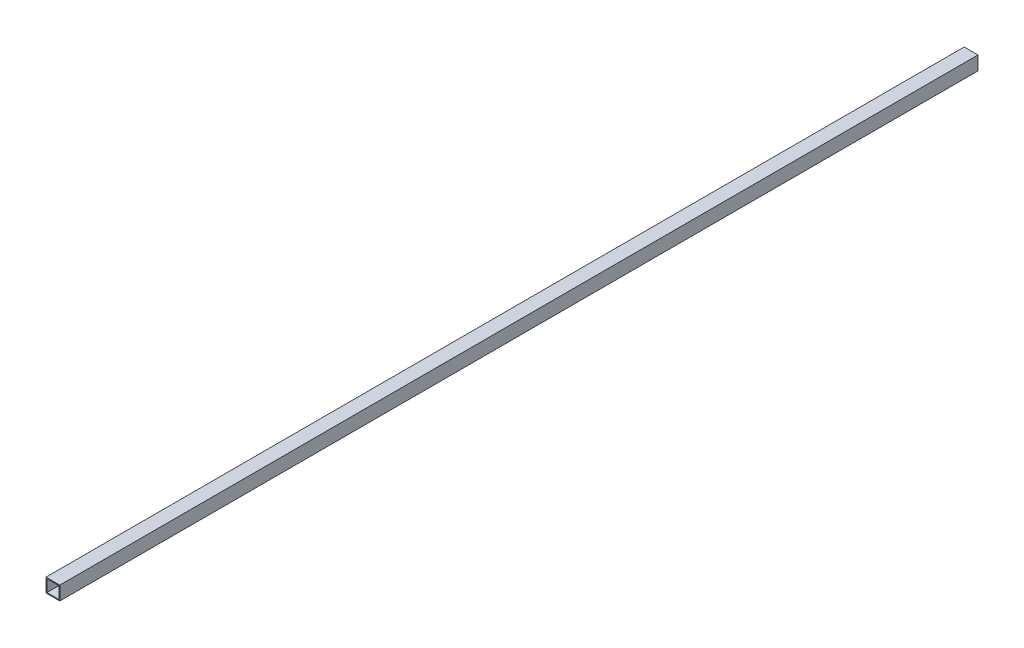
ISO-10303-21;
HEADER;
FILE_DESCRIPTION(('STEP AP214'),'2;1');
FILE_NAME('part.step','',(''),(''),'','','');
FILE_SCHEMA(('AUTOMOTIVE_DESIGN { 1 0 10303 214 1 1 1 1 }'));
ENDSEC;
DATA;
#1=APPLICATION_CONTEXT('core data for automotive mechanical design processes');
#2=APPLICATION_PROTOCOL_DEFINITION('international standard','automotive_design',2000,#1);
#3=PRODUCT_CONTEXT('',#1,'mechanical');
#4=PRODUCT('Part','Part','',(#3));
#5=PRODUCT_RELATED_PRODUCT_CATEGORY('part','',(#4));
#6=PRODUCT_DEFINITION_FORMATION('','',#4);
#7=PRODUCT_DEFINITION_CONTEXT('part definition',#1,'design');
#8=PRODUCT_DEFINITION('design','',#6,#7);
#9=PRODUCT_DEFINITION_SHAPE('','',#8);
#10=(LENGTH_UNIT() NAMED_UNIT(*) SI_UNIT(.MILLI.,.METRE.));
#11=(NAMED_UNIT(*) PLANE_ANGLE_UNIT() SI_UNIT($,.RADIAN.));
#12=(NAMED_UNIT(*) SI_UNIT($,.STERADIAN.) SOLID_ANGLE_UNIT());
#13=UNCERTAINTY_MEASURE_WITH_UNIT(LENGTH_MEASURE(1.E-05),#10,'distance_accuracy_value','');
#14=(GEOMETRIC_REPRESENTATION_CONTEXT(3) GLOBAL_UNCERTAINTY_ASSIGNED_CONTEXT((#13)) GLOBAL_UNIT_ASSIGNED_CONTEXT((#10,
#11,#12)) REPRESENTATION_CONTEXT('',''));
#15=CARTESIAN_POINT('',(0.,0.,0.));
#16=DIRECTION('',(0.,0.,1.));
#17=DIRECTION('',(1.,0.,0.));
#18=AXIS2_PLACEMENT_3D('',#15,#16,#17);
#19=CARTESIAN_POINT('',(0.,0.,1995.5));
#20=DIRECTION('',(0.,0.,-1.));
#21=DIRECTION('',(-1.,0.,0.));
#22=AXIS2_PLACEMENT_3D('',#19,#20,#21);
#23=PLANE('',#22);
#24=DIRECTION('',(0.,-1.,0.));
#25=VECTOR('',#24,1.);
#26=CARTESIAN_POINT('',(-15.,15.,1995.5));
#27=LINE('',#26,#25);
#28=CARTESIAN_POINT('',(-15.,15.,1995.5));
#29=VERTEX_POINT('',#28);
#30=CARTESIAN_POINT('',(-15.,-15.,1995.5));
#31=VERTEX_POINT('',#30);
#32=EDGE_CURVE('E135',#29,#31,#27,.T.);
#33=ORIENTED_EDGE('',*,*,#32,.T.);
#34=DIRECTION('',(1.,0.,0.));
#35=VECTOR('',#34,1.);
#36=CARTESIAN_POINT('',(15.,-15.,1995.5));
#37=LINE('',#36,#35);
#38=CARTESIAN_POINT('',(15.,-15.,1995.5));
#39=VERTEX_POINT('',#38);
#40=EDGE_CURVE('E138',#31,#39,#37,.T.);
#41=ORIENTED_EDGE('',*,*,#40,.T.);
#42=DIRECTION('',(0.,1.,0.));
#43=VECTOR('',#42,1.);
#44=CARTESIAN_POINT('',(15.,15.,1995.5));
#45=LINE('',#44,#43);
#46=CARTESIAN_POINT('',(15.,15.,1995.5));
#47=VERTEX_POINT('',#46);
#48=EDGE_CURVE('E141',#39,#47,#45,.T.);
#49=ORIENTED_EDGE('',*,*,#48,.T.);
#50=DIRECTION('',(-1.,0.,0.));
#51=VECTOR('',#50,1.);
#52=CARTESIAN_POINT('',(15.,15.,1995.5));
#53=LINE('',#52,#51);
#54=EDGE_CURVE('E143',#47,#29,#53,.T.);
#55=ORIENTED_EDGE('',*,*,#54,.T.);
#56=EDGE_LOOP('',(#33,#41,#49,#55));
#57=FACE_BOUND('',#56,.T.);
#58=DIRECTION('',(0.,1.,0.));
#59=VECTOR('',#58,1.);
#60=CARTESIAN_POINT('',(13.,13.,1995.5));
#61=LINE('',#60,#59);
#62=CARTESIAN_POINT('',(13.,-13.,1995.5));
#63=VERTEX_POINT('',#62);
#64=CARTESIAN_POINT('',(13.,13.,1995.5));
#65=VERTEX_POINT('',#64);
#66=EDGE_CURVE('E99',#63,#65,#61,.T.);
#67=ORIENTED_EDGE('',*,*,#66,.F.);
#68=DIRECTION('',(1.,0.,0.));
#69=VECTOR('',#68,1.);
#70=CARTESIAN_POINT('',(13.,-13.,1995.5));
#71=LINE('',#70,#69);
#72=CARTESIAN_POINT('',(-13.,-13.,1995.5));
#73=VERTEX_POINT('',#72);
#74=EDGE_CURVE('E121',#73,#63,#71,.T.);
#75=ORIENTED_EDGE('',*,*,#74,.F.);
#76=DIRECTION('',(0.,-1.,0.));
#77=VECTOR('',#76,1.);
#78=CARTESIAN_POINT('',(-13.,13.,1995.5));
#79=LINE('',#78,#77);
#80=CARTESIAN_POINT('',(-13.,13.,1995.5));
#81=VERTEX_POINT('',#80);
#82=EDGE_CURVE('E119',#81,#73,#79,.T.);
#83=ORIENTED_EDGE('',*,*,#82,.F.);
#84=DIRECTION('',(-1.,0.,0.));
#85=VECTOR('',#84,1.);
#86=CARTESIAN_POINT('',(13.,13.,1995.5));
#87=LINE('',#86,#85);
#88=EDGE_CURVE('E107',#65,#81,#87,.T.);
#89=ORIENTED_EDGE('',*,*,#88,.F.);
#90=EDGE_LOOP('',(#67,#75,#83,#89));
#91=FACE_BOUND('',#90,.T.);
#92=ADVANCED_FACE('F34',(#57,#91),#23,.F.);
#93=CARTESIAN_POINT('',(0.,0.,0.));
#94=DIRECTION('',(0.,0.,-1.));
#95=DIRECTION('',(-1.,0.,0.));
#96=AXIS2_PLACEMENT_3D('',#93,#94,#95);
#97=PLANE('',#96);
#98=DIRECTION('',(0.,-1.,0.));
#99=VECTOR('',#98,1.);
#100=CARTESIAN_POINT('',(-15.,15.,0.));
#101=LINE('',#100,#99);
#102=CARTESIAN_POINT('',(-15.,15.,0.));
#103=VERTEX_POINT('',#102);
#104=CARTESIAN_POINT('',(-15.,-15.,0.));
#105=VERTEX_POINT('',#104);
#106=EDGE_CURVE('E115',#103,#105,#101,.T.);
#107=ORIENTED_EDGE('',*,*,#106,.F.);
#108=DIRECTION('',(-1.,0.,0.));
#109=VECTOR('',#108,1.);
#110=CARTESIAN_POINT('',(15.,15.,0.));
#111=LINE('',#110,#109);
#112=CARTESIAN_POINT('',(15.,15.,0.));
#113=VERTEX_POINT('',#112);
#114=EDGE_CURVE('E139',#113,#103,#111,.T.);
#115=ORIENTED_EDGE('',*,*,#114,.F.);
#116=DIRECTION('',(0.,1.,0.));
#117=VECTOR('',#116,1.);
#118=CARTESIAN_POINT('',(15.,15.,0.));
#119=LINE('',#118,#117);
#120=CARTESIAN_POINT('',(15.,-15.,0.));
#121=VERTEX_POINT('',#120);
#122=EDGE_CURVE('E150',#121,#113,#119,.T.);
#123=ORIENTED_EDGE('',*,*,#122,.F.);
#124=DIRECTION('',(1.,0.,0.));
#125=VECTOR('',#124,1.);
#126=CARTESIAN_POINT('',(15.,-15.,0.));
#127=LINE('',#126,#125);
#128=EDGE_CURVE('E148',#105,#121,#127,.T.);
#129=ORIENTED_EDGE('',*,*,#128,.F.);
#130=EDGE_LOOP('',(#107,#115,#123,#129));
#131=FACE_BOUND('',#130,.T.);
#132=DIRECTION('',(1.,0.,0.));
#133=VECTOR('',#132,1.);
#134=CARTESIAN_POINT('',(13.,-13.,0.));
#135=LINE('',#134,#133);
#136=CARTESIAN_POINT('',(-13.,-13.,0.));
#137=VERTEX_POINT('',#136);
#138=CARTESIAN_POINT('',(13.,-13.,0.));
#139=VERTEX_POINT('',#138);
#140=EDGE_CURVE('E108',#137,#139,#135,.T.);
#141=ORIENTED_EDGE('',*,*,#140,.T.);
#142=DIRECTION('',(0.,1.,0.));
#143=VECTOR('',#142,1.);
#144=CARTESIAN_POINT('',(13.,13.,0.));
#145=LINE('',#144,#143);
#146=CARTESIAN_POINT('',(13.,13.,0.));
#147=VERTEX_POINT('',#146);
#148=EDGE_CURVE('E57',#139,#147,#145,.T.);
#149=ORIENTED_EDGE('',*,*,#148,.T.);
#150=DIRECTION('',(-1.,0.,0.));
#151=VECTOR('',#150,1.);
#152=CARTESIAN_POINT('',(13.,13.,0.));
#153=LINE('',#152,#151);
#154=CARTESIAN_POINT('',(-13.,13.,0.));
#155=VERTEX_POINT('',#154);
#156=EDGE_CURVE('E114',#147,#155,#153,.T.);
#157=ORIENTED_EDGE('',*,*,#156,.T.);
#158=DIRECTION('',(0.,-1.,0.));
#159=VECTOR('',#158,1.);
#160=CARTESIAN_POINT('',(-13.,13.,0.));
#161=LINE('',#160,#159);
#162=EDGE_CURVE('E127',#155,#137,#161,.T.);
#163=ORIENTED_EDGE('',*,*,#162,.T.);
#164=EDGE_LOOP('',(#141,#149,#157,#163));
#165=FACE_BOUND('',#164,.T.);
#166=ADVANCED_FACE('F168',(#131,#165),#97,.T.);
#167=CARTESIAN_POINT('',(-15.,15.,1995.5));
#168=DIRECTION('',(1.,0.,0.));
#169=DIRECTION('',(0.,1.,0.));
#170=AXIS2_PLACEMENT_3D('',#167,#168,#169);
#171=PLANE('',#170);
#172=ORIENTED_EDGE('',*,*,#106,.T.);
#173=DIRECTION('',(0.,0.,-1.));
#174=VECTOR('',#173,1.);
#175=CARTESIAN_POINT('',(-15.,-15.,1995.5));
#176=LINE('',#175,#174);
#177=EDGE_CURVE('E11',#31,#105,#176,.T.);
#178=ORIENTED_EDGE('',*,*,#177,.F.);
#179=ORIENTED_EDGE('',*,*,#32,.F.);
#180=DIRECTION('',(0.,0.,-1.));
#181=VECTOR('',#180,1.);
#182=CARTESIAN_POINT('',(-15.,15.,1995.5));
#183=LINE('',#182,#181);
#184=EDGE_CURVE('E145',#29,#103,#183,.T.);
#185=ORIENTED_EDGE('',*,*,#184,.T.);
#186=EDGE_LOOP('',(#172,#178,#179,#185));
#187=FACE_BOUND('',#186,.T.);
#188=ADVANCED_FACE('F36',(#187),#171,.F.);
#189=CARTESIAN_POINT('',(15.,-15.,1995.5));
#190=DIRECTION('',(0.,1.,0.));
#191=DIRECTION('',(-1.,0.,0.));
#192=AXIS2_PLACEMENT_3D('',#189,#190,#191);
#193=PLANE('',#192);
#194=ORIENTED_EDGE('',*,*,#128,.T.);
#195=DIRECTION('',(0.,0.,-1.));
#196=VECTOR('',#195,1.);
#197=CARTESIAN_POINT('',(15.,-15.,1995.5));
#198=LINE('',#197,#196);
#199=EDGE_CURVE('E42',#39,#121,#198,.T.);
#200=ORIENTED_EDGE('',*,*,#199,.F.);
#201=ORIENTED_EDGE('',*,*,#40,.F.);
#202=ORIENTED_EDGE('',*,*,#177,.T.);
#203=EDGE_LOOP('',(#194,#200,#201,#202));
#204=FACE_BOUND('',#203,.T.);
#205=ADVANCED_FACE('F178',(#204),#193,.F.);
#206=CARTESIAN_POINT('',(15.,15.,1995.5));
#207=DIRECTION('',(-1.,0.,0.));
#208=DIRECTION('',(0.,-1.,0.));
#209=AXIS2_PLACEMENT_3D('',#206,#207,#208);
#210=PLANE('',#209);
#211=ORIENTED_EDGE('',*,*,#122,.T.);
#212=DIRECTION('',(0.,0.,-1.));
#213=VECTOR('',#212,1.);
#214=CARTESIAN_POINT('',(15.,15.,1995.5));
#215=LINE('',#214,#213);
#216=EDGE_CURVE('E155',#47,#113,#215,.T.);
#217=ORIENTED_EDGE('',*,*,#216,.F.);
#218=ORIENTED_EDGE('',*,*,#48,.F.);
#219=ORIENTED_EDGE('',*,*,#199,.T.);
#220=EDGE_LOOP('',(#211,#217,#218,#219));
#221=FACE_BOUND('',#220,.T.);
#222=ADVANCED_FACE('F162',(#221),#210,.F.);
#223=CARTESIAN_POINT('',(15.,15.,1995.5));
#224=DIRECTION('',(0.,-1.,0.));
#225=DIRECTION('',(1.,0.,0.));
#226=AXIS2_PLACEMENT_3D('',#223,#224,#225);
#227=PLANE('',#226);
#228=ORIENTED_EDGE('',*,*,#114,.T.);
#229=ORIENTED_EDGE('',*,*,#184,.F.);
#230=ORIENTED_EDGE('',*,*,#54,.F.);
#231=ORIENTED_EDGE('',*,*,#216,.T.);
#232=EDGE_LOOP('',(#228,#229,#230,#231));
#233=FACE_BOUND('',#232,.T.);
#234=ADVANCED_FACE('F172',(#233),#227,.F.);
#235=CARTESIAN_POINT('',(13.,13.,1995.5));
#236=DIRECTION('',(-1.,0.,0.));
#237=DIRECTION('',(0.,-1.,0.));
#238=AXIS2_PLACEMENT_3D('',#235,#236,#237);
#239=PLANE('',#238);
#240=ORIENTED_EDGE('',*,*,#148,.F.);
#241=DIRECTION('',(0.,0.,-1.));
#242=VECTOR('',#241,1.);
#243=CARTESIAN_POINT('',(13.,-13.,1995.5));
#244=LINE('',#243,#242);
#245=EDGE_CURVE('E103',#63,#139,#244,.T.);
#246=ORIENTED_EDGE('',*,*,#245,.F.);
#247=ORIENTED_EDGE('',*,*,#66,.T.);
#248=DIRECTION('',(0.,0.,-1.));
#249=VECTOR('',#248,1.);
#250=CARTESIAN_POINT('',(13.,13.,1995.5));
#251=LINE('',#250,#249);
#252=EDGE_CURVE('E102',#65,#147,#251,.T.);
#253=ORIENTED_EDGE('',*,*,#252,.T.);
#254=EDGE_LOOP('',(#240,#246,#247,#253));
#255=FACE_BOUND('',#254,.T.);
#256=ADVANCED_FACE('F101',(#255),#239,.T.);
#257=CARTESIAN_POINT('',(13.,13.,1995.5));
#258=DIRECTION('',(0.,-1.,0.));
#259=DIRECTION('',(1.,0.,0.));
#260=AXIS2_PLACEMENT_3D('',#257,#258,#259);
#261=PLANE('',#260);
#262=ORIENTED_EDGE('',*,*,#156,.F.);
#263=ORIENTED_EDGE('',*,*,#252,.F.);
#264=ORIENTED_EDGE('',*,*,#88,.T.);
#265=DIRECTION('',(0.,0.,-1.));
#266=VECTOR('',#265,1.);
#267=CARTESIAN_POINT('',(-13.,13.,1995.5));
#268=LINE('',#267,#266);
#269=EDGE_CURVE('E116',#81,#155,#268,.T.);
#270=ORIENTED_EDGE('',*,*,#269,.T.);
#271=EDGE_LOOP('',(#262,#263,#264,#270));
#272=FACE_BOUND('',#271,.T.);
#273=ADVANCED_FACE('F111',(#272),#261,.T.);
#274=CARTESIAN_POINT('',(-13.,13.,1995.5));
#275=DIRECTION('',(1.,0.,0.));
#276=DIRECTION('',(0.,1.,0.));
#277=AXIS2_PLACEMENT_3D('',#274,#275,#276);
#278=PLANE('',#277);
#279=ORIENTED_EDGE('',*,*,#162,.F.);
#280=ORIENTED_EDGE('',*,*,#269,.F.);
#281=ORIENTED_EDGE('',*,*,#82,.T.);
#282=DIRECTION('',(0.,0.,-1.));
#283=VECTOR('',#282,1.);
#284=CARTESIAN_POINT('',(-13.,-13.,1995.5));
#285=LINE('',#284,#283);
#286=EDGE_CURVE('E49',#73,#137,#285,.T.);
#287=ORIENTED_EDGE('',*,*,#286,.T.);
#288=EDGE_LOOP('',(#279,#280,#281,#287));
#289=FACE_BOUND('',#288,.T.);
#290=ADVANCED_FACE('F201',(#289),#278,.T.);
#291=CARTESIAN_POINT('',(13.,-13.,1995.5));
#292=DIRECTION('',(0.,1.,0.));
#293=DIRECTION('',(-1.,0.,0.));
#294=AXIS2_PLACEMENT_3D('',#291,#292,#293);
#295=PLANE('',#294);
#296=ORIENTED_EDGE('',*,*,#140,.F.);
#297=ORIENTED_EDGE('',*,*,#286,.F.);
#298=ORIENTED_EDGE('',*,*,#74,.T.);
#299=ORIENTED_EDGE('',*,*,#245,.T.);
#300=EDGE_LOOP('',(#296,#297,#298,#299));
#301=FACE_BOUND('',#300,.T.);
#302=ADVANCED_FACE('F205',(#301),#295,.T.);
#303=CLOSED_SHELL('',(#92,#166,#188,#205,#222,#234,#256,#273,#290,#302));
#304=MANIFOLD_SOLID_BREP('B2',#303);
#305=ADVANCED_BREP_SHAPE_REPRESENTATION('',(#18,#304),#14);
#306=SHAPE_DEFINITION_REPRESENTATION(#9,#305);
ENDSEC;
END-ISO-10303-21;
